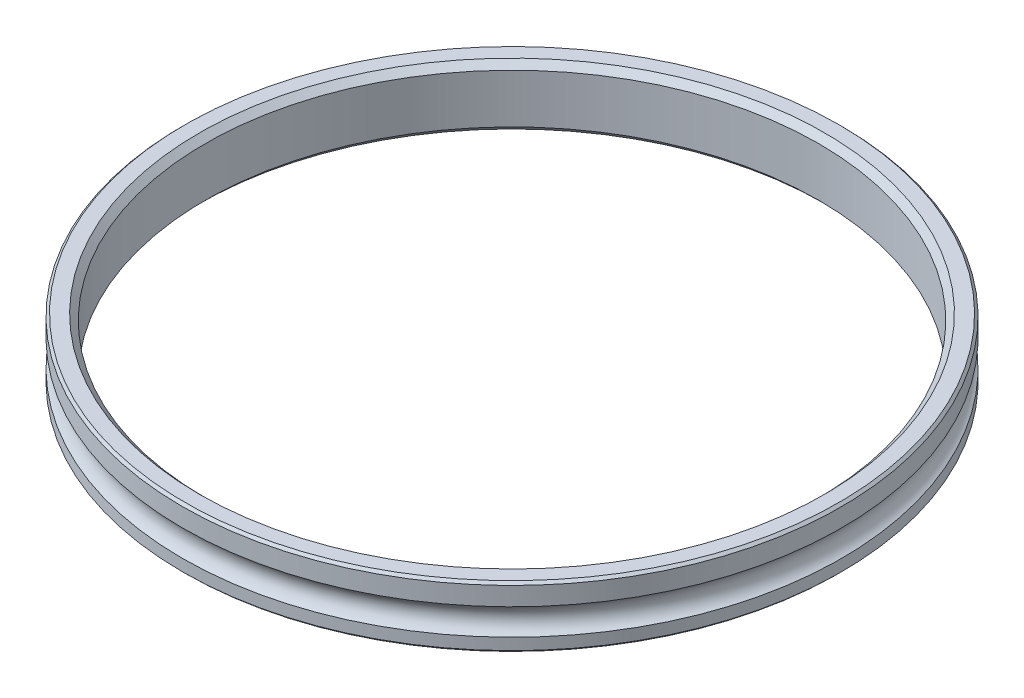
ISO-10303-21;
HEADER;
FILE_DESCRIPTION(('STEP AP214'),'2;1');
FILE_NAME('part.step','',(''),(''),'','','');
FILE_SCHEMA(('AUTOMOTIVE_DESIGN { 1 0 10303 214 1 1 1 1 }'));
ENDSEC;
DATA;
#1=APPLICATION_CONTEXT('core data for automotive mechanical design processes');
#2=APPLICATION_PROTOCOL_DEFINITION('international standard','automotive_design',2000,#1);
#3=PRODUCT_CONTEXT('',#1,'mechanical');
#4=PRODUCT('Part','Part','',(#3));
#5=PRODUCT_RELATED_PRODUCT_CATEGORY('part','',(#4));
#6=PRODUCT_DEFINITION_FORMATION('','',#4);
#7=PRODUCT_DEFINITION_CONTEXT('part definition',#1,'design');
#8=PRODUCT_DEFINITION('design','',#6,#7);
#9=PRODUCT_DEFINITION_SHAPE('','',#8);
#10=(LENGTH_UNIT() NAMED_UNIT(*) SI_UNIT(.MILLI.,.METRE.));
#11=(NAMED_UNIT(*) PLANE_ANGLE_UNIT() SI_UNIT($,.RADIAN.));
#12=(NAMED_UNIT(*) SI_UNIT($,.STERADIAN.) SOLID_ANGLE_UNIT());
#13=UNCERTAINTY_MEASURE_WITH_UNIT(LENGTH_MEASURE(1.E-05),#10,'distance_accuracy_value','');
#14=(GEOMETRIC_REPRESENTATION_CONTEXT(3) GLOBAL_UNCERTAINTY_ASSIGNED_CONTEXT((#13)) GLOBAL_UNIT_ASSIGNED_CONTEXT((#10,
#11,#12)) REPRESENTATION_CONTEXT('',''));
#15=CARTESIAN_POINT('',(0.,0.,0.));
#16=DIRECTION('',(0.,0.,1.));
#17=DIRECTION('',(1.,0.,0.));
#18=AXIS2_PLACEMENT_3D('',#15,#16,#17);
#19=CARTESIAN_POINT('',(0.,0.,0.));
#20=DIRECTION('',(0.,-1.,0.));
#21=DIRECTION('',(0.,0.,-1.));
#22=AXIS2_PLACEMENT_3D('',#19,#20,#21);
#23=TOROIDAL_SURFACE('',#22,34.925,1.5875);
#24=CARTESIAN_POINT('',(0.,1.36363939881481,0.));
#25=DIRECTION('',(0.,1.,0.));
#26=DIRECTION('',(0.,0.,1.));
#27=AXIS2_PLACEMENT_3D('',#24,#25,#26);
#28=CIRCLE('',#27,34.1122);
#29=CARTESIAN_POINT('',(0.,1.36363939881481,34.1122));
#30=VERTEX_POINT('',#29);
#31=EDGE_CURVE('E39',#30,#30,#28,.T.);
#32=ORIENTED_EDGE('',*,*,#31,.F.);
#33=EDGE_LOOP('',(#32));
#34=FACE_BOUND('',#33,.T.);
#35=CARTESIAN_POINT('',(0.,-1.36363939881481,0.));
#36=DIRECTION('',(0.,1.,0.));
#37=DIRECTION('',(0.,0.,1.));
#38=AXIS2_PLACEMENT_3D('',#35,#36,#37);
#39=CIRCLE('',#38,34.1122);
#40=CARTESIAN_POINT('',(0.,-1.36363939881481,34.1122));
#41=VERTEX_POINT('',#40);
#42=EDGE_CURVE('E37',#41,#41,#39,.F.);
#43=ORIENTED_EDGE('',*,*,#42,.F.);
#44=EDGE_LOOP('',(#43));
#45=FACE_BOUND('',#44,.T.);
#46=ADVANCED_FACE('F15',(#34,#45),#23,.F.);
#47=CARTESIAN_POINT('',(0.,28.6564102564103,0.));
#48=DIRECTION('',(0.,1.,0.));
#49=DIRECTION('',(0.,0.,1.));
#50=AXIS2_PLACEMENT_3D('',#47,#48,#49);
#51=CYLINDRICAL_SURFACE('',#50,34.1122);
#52=CARTESIAN_POINT('',(0.,3.2766,0.));
#53=DIRECTION('',(0.,-1.,0.));
#54=DIRECTION('',(0.,0.,-1.));
#55=AXIS2_PLACEMENT_3D('',#52,#53,#54);
#56=CIRCLE('',#55,34.1122);
#57=CARTESIAN_POINT('',(0.,3.2766,-34.1122));
#58=VERTEX_POINT('',#57);
#59=EDGE_CURVE('E34',#58,#58,#56,.F.);
#60=ORIENTED_EDGE('',*,*,#59,.F.);
#61=EDGE_LOOP('',(#60));
#62=FACE_BOUND('',#61,.T.);
#63=ORIENTED_EDGE('',*,*,#31,.T.);
#64=EDGE_LOOP('',(#63));
#65=FACE_BOUND('',#64,.T.);
#66=ADVANCED_FACE('F70',(#62,#65),#51,.T.);
#67=CARTESIAN_POINT('',(0.,28.6564102564103,0.));
#68=DIRECTION('',(0.,1.,0.));
#69=DIRECTION('',(0.,0.,1.));
#70=AXIS2_PLACEMENT_3D('',#67,#68,#69);
#71=CYLINDRICAL_SURFACE('',#70,34.1122);
#72=ORIENTED_EDGE('',*,*,#42,.T.);
#73=EDGE_LOOP('',(#72));
#74=FACE_BOUND('',#73,.T.);
#75=CARTESIAN_POINT('',(0.,-2.5654,0.));
#76=DIRECTION('',(0.,1.,0.));
#77=DIRECTION('',(0.,0.,1.));
#78=AXIS2_PLACEMENT_3D('',#75,#76,#77);
#79=CIRCLE('',#78,34.1122);
#80=CARTESIAN_POINT('',(0.,-2.5654,34.1122));
#81=VERTEX_POINT('',#80);
#82=EDGE_CURVE('E31',#81,#81,#79,.F.);
#83=ORIENTED_EDGE('',*,*,#82,.F.);
#84=EDGE_LOOP('',(#83));
#85=FACE_BOUND('',#84,.T.);
#86=ADVANCED_FACE('F60',(#74,#85),#71,.T.);
#87=CARTESIAN_POINT('',(0.,3.2766,0.));
#88=DIRECTION('',(0.,-1.,0.));
#89=DIRECTION('',(0.,0.,-1.));
#90=AXIS2_PLACEMENT_3D('',#87,#88,#89);
#91=CONICAL_SURFACE('',#90,34.1122,0.785398163397461);
#92=ORIENTED_EDGE('',*,*,#59,.T.);
#93=EDGE_LOOP('',(#92));
#94=FACE_BOUND('',#93,.T.);
#95=CARTESIAN_POINT('',(0.,3.5306,0.));
#96=DIRECTION('',(0.,-1.,0.));
#97=DIRECTION('',(0.,0.,-1.));
#98=AXIS2_PLACEMENT_3D('',#95,#96,#97);
#99=CIRCLE('',#98,33.8582);
#100=CARTESIAN_POINT('',(0.,3.5306,-33.8582));
#101=VERTEX_POINT('',#100);
#102=EDGE_CURVE('E19',#101,#101,#99,.F.);
#103=ORIENTED_EDGE('',*,*,#102,.F.);
#104=EDGE_LOOP('',(#103));
#105=FACE_BOUND('',#104,.T.);
#106=ADVANCED_FACE('F57',(#94,#105),#91,.T.);
#107=CARTESIAN_POINT('',(0.,-2.5654,0.));
#108=DIRECTION('',(0.,1.,0.));
#109=DIRECTION('',(0.,0.,1.));
#110=AXIS2_PLACEMENT_3D('',#107,#108,#109);
#111=CONICAL_SURFACE('',#110,34.1122,0.785398163397461);
#112=ORIENTED_EDGE('',*,*,#82,.T.);
#113=EDGE_LOOP('',(#112));
#114=FACE_BOUND('',#113,.T.);
#115=CARTESIAN_POINT('',(0.,-2.8194,0.));
#116=DIRECTION('',(0.,1.,0.));
#117=DIRECTION('',(0.,0.,1.));
#118=AXIS2_PLACEMENT_3D('',#115,#116,#117);
#119=CIRCLE('',#118,33.8582);
#120=CARTESIAN_POINT('',(0.,-2.8194,33.8582));
#121=VERTEX_POINT('',#120);
#122=EDGE_CURVE('E48',#121,#121,#119,.F.);
#123=ORIENTED_EDGE('',*,*,#122,.F.);
#124=EDGE_LOOP('',(#123));
#125=FACE_BOUND('',#124,.T.);
#126=ADVANCED_FACE('F59',(#114,#125),#111,.T.);
#127=CARTESIAN_POINT('',(-34.1122,3.5306,0.));
#128=DIRECTION('',(0.,1.,0.));
#129=DIRECTION('',(0.,0.,1.));
#130=AXIS2_PLACEMENT_3D('',#127,#128,#129);
#131=PLANE('',#130);
#132=CARTESIAN_POINT('',(0.,3.53059999999999,0.));
#133=DIRECTION('',(0.,1.,0.));
#134=DIRECTION('',(0.,0.,1.));
#135=AXIS2_PLACEMENT_3D('',#132,#133,#134);
#136=CIRCLE('',#135,32.385);
#137=CARTESIAN_POINT('',(0.,3.53059999999999,32.385));
#138=VERTEX_POINT('',#137);
#139=EDGE_CURVE('E46',#138,#138,#136,.F.);
#140=ORIENTED_EDGE('',*,*,#139,.T.);
#141=EDGE_LOOP('',(#140));
#142=FACE_BOUND('',#141,.T.);
#143=ORIENTED_EDGE('',*,*,#102,.T.);
#144=EDGE_LOOP('',(#143));
#145=FACE_BOUND('',#144,.T.);
#146=ADVANCED_FACE('F55',(#142,#145),#131,.T.);
#147=CARTESIAN_POINT('',(-34.1122,-2.8194,0.));
#148=DIRECTION('',(0.,-1.,0.));
#149=DIRECTION('',(0.,0.,-1.));
#150=AXIS2_PLACEMENT_3D('',#147,#148,#149);
#151=PLANE('',#150);
#152=CARTESIAN_POINT('',(0.,-2.8194,0.));
#153=DIRECTION('',(0.,-1.,0.));
#154=DIRECTION('',(0.,0.,-1.));
#155=AXIS2_PLACEMENT_3D('',#152,#153,#154);
#156=CIRCLE('',#155,32.385);
#157=CARTESIAN_POINT('',(0.,-2.8194,-32.385));
#158=VERTEX_POINT('',#157);
#159=EDGE_CURVE('E28',#158,#158,#156,.F.);
#160=ORIENTED_EDGE('',*,*,#159,.T.);
#161=EDGE_LOOP('',(#160));
#162=FACE_BOUND('',#161,.T.);
#163=ORIENTED_EDGE('',*,*,#122,.T.);
#164=EDGE_LOOP('',(#163));
#165=FACE_BOUND('',#164,.T.);
#166=ADVANCED_FACE('F88',(#162,#165),#151,.T.);
#167=CARTESIAN_POINT('',(0.,3.53059999999999,0.));
#168=DIRECTION('',(0.,1.,0.));
#169=DIRECTION('',(0.,0.,1.));
#170=AXIS2_PLACEMENT_3D('',#167,#168,#169);
#171=CONICAL_SURFACE('',#170,32.385,0.785398163397456);
#172=ORIENTED_EDGE('',*,*,#139,.F.);
#173=EDGE_LOOP('',(#172));
#174=FACE_BOUND('',#173,.T.);
#175=CARTESIAN_POINT('',(0.,2.8956,0.));
#176=DIRECTION('',(0.,1.,0.));
#177=DIRECTION('',(0.,0.,1.));
#178=AXIS2_PLACEMENT_3D('',#175,#176,#177);
#179=CIRCLE('',#178,31.75);
#180=CARTESIAN_POINT('',(0.,2.8956,31.75));
#181=VERTEX_POINT('',#180);
#182=EDGE_CURVE('E23',#181,#181,#179,.F.);
#183=ORIENTED_EDGE('',*,*,#182,.T.);
#184=EDGE_LOOP('',(#183));
#185=FACE_BOUND('',#184,.T.);
#186=ADVANCED_FACE('F81',(#174,#185),#171,.F.);
#187=CARTESIAN_POINT('',(0.,-2.8194,0.));
#188=DIRECTION('',(0.,-1.,0.));
#189=DIRECTION('',(0.,0.,-1.));
#190=AXIS2_PLACEMENT_3D('',#187,#188,#189);
#191=CONICAL_SURFACE('',#190,32.385,0.785398163397446);
#192=CARTESIAN_POINT('',(0.,-2.1844,0.));
#193=DIRECTION('',(0.,1.,0.));
#194=DIRECTION('',(0.,0.,1.));
#195=AXIS2_PLACEMENT_3D('',#192,#193,#194);
#196=CIRCLE('',#195,31.75);
#197=CARTESIAN_POINT('',(0.,-2.1844,31.75));
#198=VERTEX_POINT('',#197);
#199=EDGE_CURVE('E10',#198,#198,#196,.T.);
#200=ORIENTED_EDGE('',*,*,#199,.T.);
#201=EDGE_LOOP('',(#200));
#202=FACE_BOUND('',#201,.T.);
#203=ORIENTED_EDGE('',*,*,#159,.F.);
#204=EDGE_LOOP('',(#203));
#205=FACE_BOUND('',#204,.T.);
#206=ADVANCED_FACE('F75',(#202,#205),#191,.F.);
#207=CARTESIAN_POINT('',(0.,28.6564102564103,0.));
#208=DIRECTION('',(0.,1.,0.));
#209=DIRECTION('',(0.,0.,1.));
#210=AXIS2_PLACEMENT_3D('',#207,#208,#209);
#211=CYLINDRICAL_SURFACE('',#210,31.75);
#212=ORIENTED_EDGE('',*,*,#182,.F.);
#213=EDGE_LOOP('',(#212));
#214=FACE_BOUND('',#213,.T.);
#215=ORIENTED_EDGE('',*,*,#199,.F.);
#216=EDGE_LOOP('',(#215));
#217=FACE_BOUND('',#216,.T.);
#218=ADVANCED_FACE('F73',(#214,#217),#211,.F.);
#219=CLOSED_SHELL('',(#46,#66,#86,#106,#126,#146,#166,#186,#206,#218));
#220=MANIFOLD_SOLID_BREP('B1',#219);
#221=ADVANCED_BREP_SHAPE_REPRESENTATION('',(#18,#220),#14);
#222=SHAPE_DEFINITION_REPRESENTATION(#9,#221);
ENDSEC;
END-ISO-10303-21;
